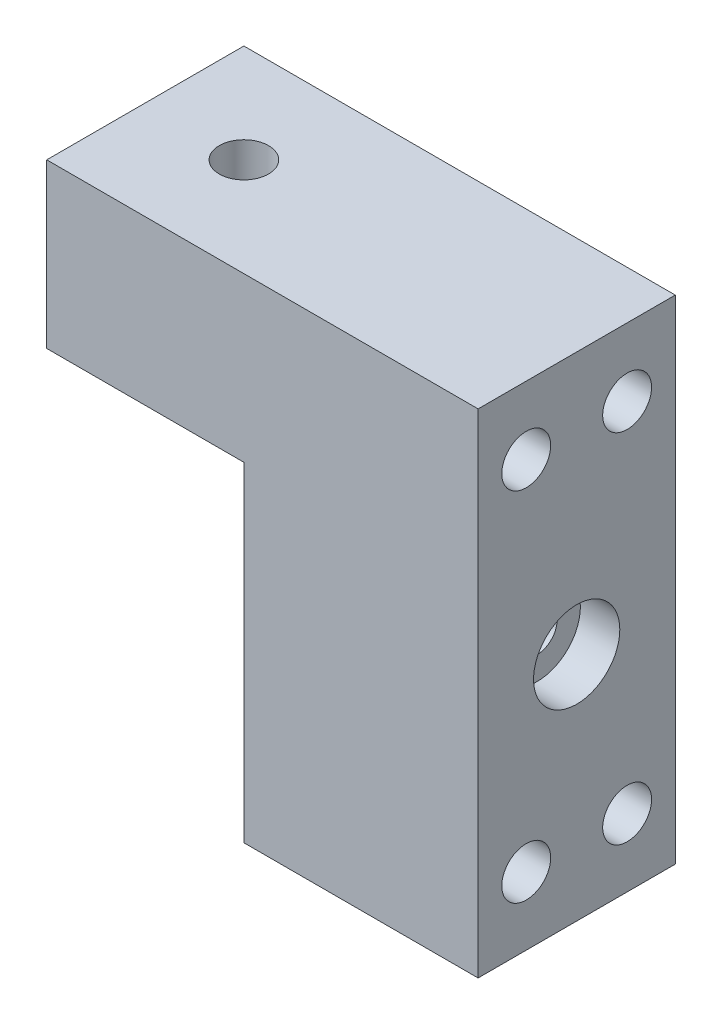
ISO-10303-21;
HEADER;
FILE_DESCRIPTION(('STEP AP214'),'2;1');
FILE_NAME('part.step','',(''),(''),'','','');
FILE_SCHEMA(('AUTOMOTIVE_DESIGN { 1 0 10303 214 1 1 1 1 }'));
ENDSEC;
DATA;
#1=APPLICATION_CONTEXT('core data for automotive mechanical design processes');
#2=APPLICATION_PROTOCOL_DEFINITION('international standard','automotive_design',2000,#1);
#3=PRODUCT_CONTEXT('',#1,'mechanical');
#4=PRODUCT('Part','Part','',(#3));
#5=PRODUCT_RELATED_PRODUCT_CATEGORY('part','',(#4));
#6=PRODUCT_DEFINITION_FORMATION('','',#4);
#7=PRODUCT_DEFINITION_CONTEXT('part definition',#1,'design');
#8=PRODUCT_DEFINITION('design','',#6,#7);
#9=PRODUCT_DEFINITION_SHAPE('','',#8);
#10=(LENGTH_UNIT() NAMED_UNIT(*) SI_UNIT(.MILLI.,.METRE.));
#11=(NAMED_UNIT(*) PLANE_ANGLE_UNIT() SI_UNIT($,.RADIAN.));
#12=(NAMED_UNIT(*) SI_UNIT($,.STERADIAN.) SOLID_ANGLE_UNIT());
#13=UNCERTAINTY_MEASURE_WITH_UNIT(LENGTH_MEASURE(1.E-05),#10,'distance_accuracy_value','');
#14=(GEOMETRIC_REPRESENTATION_CONTEXT(3) GLOBAL_UNCERTAINTY_ASSIGNED_CONTEXT((#13)) GLOBAL_UNIT_ASSIGNED_CONTEXT((#10,
#11,#12)) REPRESENTATION_CONTEXT('',''));
#15=CARTESIAN_POINT('',(0.,0.,0.));
#16=DIRECTION('',(0.,0.,1.));
#17=DIRECTION('',(1.,0.,0.));
#18=AXIS2_PLACEMENT_3D('',#15,#16,#17);
#19=CARTESIAN_POINT('',(-30.1759600000002,-375.537125805543,-189.91392924106));
#20=DIRECTION('',(1.,0.,0.));
#21=DIRECTION('',(0.,0.,-1.));
#22=AXIS2_PLACEMENT_3D('',#19,#20,#21);
#23=PLANE('',#22);
#24=CARTESIAN_POINT('',(-30.1759600000002,-381.861725805797,225.049350785073));
#25=DIRECTION('',(1.,0.,0.));
#26=DIRECTION('',(0.,0.,-1.));
#27=AXIS2_PLACEMENT_3D('',#24,#25,#26);
#28=CIRCLE('',#27,2.55270000000002);
#29=CARTESIAN_POINT('',(-30.1759600000002,-381.861725805797,222.496650785073));
#30=VERTEX_POINT('',#29);
#31=EDGE_CURVE('E118',#30,#30,#28,.T.);
#32=ORIENTED_EDGE('',*,*,#31,.T.);
#33=EDGE_LOOP('',(#32));
#34=FACE_BOUND('',#33,.T.);
#35=DIRECTION('',(0.,0.,1.));
#36=VECTOR('',#35,1.);
#37=CARTESIAN_POINT('',(-30.1759600000002,-369.161725805547,237.749350784974));
#38=LINE('',#37,#36);
#39=CARTESIAN_POINT('',(-30.1759600000002,-369.161725805547,212.349350784974));
#40=VERTEX_POINT('',#39);
#41=CARTESIAN_POINT('',(-30.1759600000002,-369.161725805547,237.749350784974));
#42=VERTEX_POINT('',#41);
#43=EDGE_CURVE('E49',#40,#42,#38,.T.);
#44=ORIENTED_EDGE('',*,*,#43,.F.);
#45=DIRECTION('',(0.,-1.,0.));
#46=VECTOR('',#45,1.);
#47=CARTESIAN_POINT('',(-30.1759600000002,-348.111725805595,212.349350784974));
#48=LINE('',#47,#46);
#49=CARTESIAN_POINT('',(-30.1759600000002,-411.611725805595,212.349350784974));
#50=VERTEX_POINT('',#49);
#51=EDGE_CURVE('E11',#40,#50,#48,.T.);
#52=ORIENTED_EDGE('',*,*,#51,.T.);
#53=DIRECTION('',(0.,0.,1.));
#54=VECTOR('',#53,1.);
#55=CARTESIAN_POINT('',(-30.1759600000002,-411.611725805595,212.349350784974));
#56=LINE('',#55,#54);
#57=CARTESIAN_POINT('',(-30.1759600000002,-411.611725805594,237.749350784974));
#58=VERTEX_POINT('',#57);
#59=EDGE_CURVE('E42',#50,#58,#56,.T.);
#60=ORIENTED_EDGE('',*,*,#59,.T.);
#61=DIRECTION('',(0.,1.,0.));
#62=VECTOR('',#61,1.);
#63=CARTESIAN_POINT('',(-30.1759600000002,-348.111725805595,237.749350784974));
#64=LINE('',#63,#62);
#65=EDGE_CURVE('E169',#58,#42,#64,.T.);
#66=ORIENTED_EDGE('',*,*,#65,.T.);
#67=EDGE_LOOP('',(#44,#52,#60,#66));
#68=FACE_BOUND('',#67,.T.);
#69=ADVANCED_FACE('F33',(#34,#68),#23,.F.);
#70=CARTESIAN_POINT('',(-98.5675530506084,-348.111725805595,212.349350784974));
#71=DIRECTION('',(0.,0.,-1.));
#72=DIRECTION('',(-1.,0.,0.));
#73=AXIS2_PLACEMENT_3D('',#70,#71,#72);
#74=PLANE('',#73);
#75=CARTESIAN_POINT('',(-9.78750000016149,-371.924225805582,212.349350784974));
#76=DIRECTION('',(0.,0.,-1.));
#77=DIRECTION('',(-1.,0.,0.));
#78=AXIS2_PLACEMENT_3D('',#75,#76,#77);
#79=CIRCLE('',#78,2.);
#80=CARTESIAN_POINT('',(-11.7875000001615,-371.924225805582,212.349350784974));
#81=VERTEX_POINT('',#80);
#82=EDGE_CURVE('E112',#81,#81,#79,.T.);
#83=ORIENTED_EDGE('',*,*,#82,.F.);
#84=EDGE_LOOP('',(#83));
#85=FACE_BOUND('',#84,.T.);
#86=CARTESIAN_POINT('',(-9.78750000016149,-387.799225805582,212.349350784974));
#87=DIRECTION('',(0.,0.,-1.));
#88=DIRECTION('',(-1.,0.,0.));
#89=AXIS2_PLACEMENT_3D('',#86,#87,#88);
#90=CIRCLE('',#89,2.);
#91=CARTESIAN_POINT('',(-11.7875000001615,-387.799225805582,212.349350784974));
#92=VERTEX_POINT('',#91);
#93=EDGE_CURVE('E111',#92,#92,#90,.T.);
#94=ORIENTED_EDGE('',*,*,#93,.F.);
#95=EDGE_LOOP('',(#94));
#96=FACE_BOUND('',#95,.T.);
#97=ORIENTED_EDGE('',*,*,#51,.F.);
#98=DIRECTION('',(1.,0.,0.));
#99=VECTOR('',#98,1.);
#100=CARTESIAN_POINT('',(-55.5759600000002,-369.161725805547,212.349350784974));
#101=LINE('',#100,#99);
#102=CARTESIAN_POINT('',(-55.5759600000002,-369.161725805547,212.349350784974));
#103=VERTEX_POINT('',#102);
#104=EDGE_CURVE('E165',#103,#40,#101,.T.);
#105=ORIENTED_EDGE('',*,*,#104,.F.);
#106=DIRECTION('',(0.,-1.,0.));
#107=VECTOR('',#106,1.);
#108=CARTESIAN_POINT('',(-55.5759600000002,-348.111725805595,212.349350784974));
#109=LINE('',#108,#107);
#110=CARTESIAN_POINT('',(-55.5759600000002,-348.111725805595,212.349350784974));
#111=VERTEX_POINT('',#110);
#112=EDGE_CURVE('E157',#111,#103,#109,.T.);
#113=ORIENTED_EDGE('',*,*,#112,.F.);
#114=DIRECTION('',(1.,0.,0.));
#115=VECTOR('',#114,1.);
#116=CARTESIAN_POINT('',(-98.5675530506084,-348.111725805595,212.349350784974));
#117=LINE('',#116,#115);
#118=CARTESIAN_POINT('',(0.,-348.111725805595,212.349350784974));
#119=VERTEX_POINT('',#118);
#120=EDGE_CURVE('E184',#111,#119,#117,.T.);
#121=ORIENTED_EDGE('',*,*,#120,.T.);
#122=DIRECTION('',(0.,1.,0.));
#123=VECTOR('',#122,1.);
#124=CARTESIAN_POINT('',(0.,-348.111725805595,212.349350784974));
#125=LINE('',#124,#123);
#126=CARTESIAN_POINT('',(0.,-411.611725805595,212.349350784974));
#127=VERTEX_POINT('',#126);
#128=EDGE_CURVE('E168',#127,#119,#125,.T.);
#129=ORIENTED_EDGE('',*,*,#128,.F.);
#130=DIRECTION('',(1.,0.,0.));
#131=VECTOR('',#130,1.);
#132=CARTESIAN_POINT('',(-98.5675530506084,-411.611725805595,212.349350784974));
#133=LINE('',#132,#131);
#134=EDGE_CURVE('E171',#50,#127,#133,.T.);
#135=ORIENTED_EDGE('',*,*,#134,.F.);
#136=EDGE_LOOP('',(#97,#105,#113,#121,#129,#135));
#137=FACE_BOUND('',#136,.T.);
#138=ADVANCED_FACE('F35',(#85,#96,#137),#74,.T.);
#139=CARTESIAN_POINT('',(-98.5675530506084,-411.611725805595,212.349350784974));
#140=DIRECTION('',(0.,-1.,0.));
#141=DIRECTION('',(0.,0.,-1.));
#142=AXIS2_PLACEMENT_3D('',#139,#140,#141);
#143=PLANE('',#142);
#144=ORIENTED_EDGE('',*,*,#59,.F.);
#145=ORIENTED_EDGE('',*,*,#134,.T.);
#146=DIRECTION('',(0.,0.,-1.));
#147=VECTOR('',#146,1.);
#148=CARTESIAN_POINT('',(0.,-411.611725805595,212.349350784974));
#149=LINE('',#148,#147);
#150=CARTESIAN_POINT('',(0.,-411.611725805595,237.749350784974));
#151=VERTEX_POINT('',#150);
#152=EDGE_CURVE('E181',#151,#127,#149,.T.);
#153=ORIENTED_EDGE('',*,*,#152,.F.);
#154=DIRECTION('',(1.,0.,0.));
#155=VECTOR('',#154,1.);
#156=CARTESIAN_POINT('',(-98.5675530506084,-411.611725805595,237.749350784974));
#157=LINE('',#156,#155);
#158=EDGE_CURVE('E186',#58,#151,#157,.T.);
#159=ORIENTED_EDGE('',*,*,#158,.F.);
#160=EDGE_LOOP('',(#144,#145,#153,#159));
#161=FACE_BOUND('',#160,.T.);
#162=ADVANCED_FACE('F204',(#161),#143,.T.);
#163=CARTESIAN_POINT('',(-98.5675530506084,-348.111725805595,237.749350784974));
#164=DIRECTION('',(0.,0.,1.));
#165=DIRECTION('',(1.,0.,0.));
#166=AXIS2_PLACEMENT_3D('',#163,#164,#165);
#167=PLANE('',#166);
#168=ORIENTED_EDGE('',*,*,#65,.F.);
#169=ORIENTED_EDGE('',*,*,#158,.T.);
#170=DIRECTION('',(0.,-1.,0.));
#171=VECTOR('',#170,1.);
#172=CARTESIAN_POINT('',(0.,-348.111725805595,237.749350784974));
#173=LINE('',#172,#171);
#174=CARTESIAN_POINT('',(0.,-348.111725805595,237.749350784974));
#175=VERTEX_POINT('',#174);
#176=EDGE_CURVE('E178',#175,#151,#173,.T.);
#177=ORIENTED_EDGE('',*,*,#176,.F.);
#178=DIRECTION('',(1.,0.,0.));
#179=VECTOR('',#178,1.);
#180=CARTESIAN_POINT('',(-98.5675530506084,-348.111725805595,237.749350784974));
#181=LINE('',#180,#179);
#182=CARTESIAN_POINT('',(-55.5759600000002,-348.111725805595,237.749350784974));
#183=VERTEX_POINT('',#182);
#184=EDGE_CURVE('E188',#183,#175,#181,.T.);
#185=ORIENTED_EDGE('',*,*,#184,.F.);
#186=DIRECTION('',(0.,1.,0.));
#187=VECTOR('',#186,1.);
#188=CARTESIAN_POINT('',(-55.5759600000002,-348.111725805595,237.749350784974));
#189=LINE('',#188,#187);
#190=CARTESIAN_POINT('',(-55.5759600000002,-369.161725805547,237.749350784974));
#191=VERTEX_POINT('',#190);
#192=EDGE_CURVE('E151',#191,#183,#189,.T.);
#193=ORIENTED_EDGE('',*,*,#192,.F.);
#194=DIRECTION('',(1.,0.,0.));
#195=VECTOR('',#194,1.);
#196=CARTESIAN_POINT('',(-55.5759600000002,-369.161725805547,237.749350784974));
#197=LINE('',#196,#195);
#198=EDGE_CURVE('E161',#191,#42,#197,.T.);
#199=ORIENTED_EDGE('',*,*,#198,.T.);
#200=EDGE_LOOP('',(#168,#169,#177,#185,#193,#199));
#201=FACE_BOUND('',#200,.T.);
#202=ADVANCED_FACE('F213',(#201),#167,.T.);
#203=CARTESIAN_POINT('',(-98.5675530506084,-348.111725805595,212.349350784974));
#204=DIRECTION('',(0.,1.,0.));
#205=DIRECTION('',(0.,0.,1.));
#206=AXIS2_PLACEMENT_3D('',#203,#204,#205);
#207=PLANE('',#206);
#208=CARTESIAN_POINT('',(-42.8759600000002,-348.111725805595,225.049350784974));
#209=DIRECTION('',(0.,1.,0.));
#210=DIRECTION('',(0.,0.,1.));
#211=AXIS2_PLACEMENT_3D('',#208,#209,#210);
#212=CIRCLE('',#211,3.17499999999998);
#213=CARTESIAN_POINT('',(-42.8759600000002,-348.111725805595,228.224350784974));
#214=VERTEX_POINT('',#213);
#215=EDGE_CURVE('E148',#214,#214,#212,.T.);
#216=ORIENTED_EDGE('',*,*,#215,.F.);
#217=EDGE_LOOP('',(#216));
#218=FACE_BOUND('',#217,.T.);
#219=ORIENTED_EDGE('',*,*,#120,.F.);
#220=DIRECTION('',(0.,0.,-1.));
#221=VECTOR('',#220,1.);
#222=CARTESIAN_POINT('',(-55.5759600000002,-348.111725805595,237.749350784974));
#223=LINE('',#222,#221);
#224=EDGE_CURVE('E154',#183,#111,#223,.T.);
#225=ORIENTED_EDGE('',*,*,#224,.F.);
#226=ORIENTED_EDGE('',*,*,#184,.T.);
#227=DIRECTION('',(0.,0.,1.));
#228=VECTOR('',#227,1.);
#229=CARTESIAN_POINT('',(0.,-348.111725805595,212.349350784974));
#230=LINE('',#229,#228);
#231=EDGE_CURVE('E175',#119,#175,#230,.T.);
#232=ORIENTED_EDGE('',*,*,#231,.F.);
#233=EDGE_LOOP('',(#219,#225,#226,#232));
#234=FACE_BOUND('',#233,.T.);
#235=ADVANCED_FACE('F197',(#218,#234),#207,.T.);
#236=CARTESIAN_POINT('',(0.,0.,0.));
#237=DIRECTION('',(-1.,0.,0.));
#238=DIRECTION('',(0.,0.,1.));
#239=AXIS2_PLACEMENT_3D('',#236,#237,#238);
#240=PLANE('',#239);
#241=CARTESIAN_POINT('',(0.,-381.861725805797,225.049350785073));
#242=DIRECTION('',(1.,0.,0.));
#243=DIRECTION('',(0.,0.,-1.));
#244=AXIS2_PLACEMENT_3D('',#241,#242,#243);
#245=CIRCLE('',#244,5.55624999999998);
#246=CARTESIAN_POINT('',(0.,-381.861725805797,219.493100785073));
#247=VERTEX_POINT('',#246);
#248=EDGE_CURVE('E311',#247,#247,#245,.T.);
#249=ORIENTED_EDGE('',*,*,#248,.F.);
#250=EDGE_LOOP('',(#249));
#251=FACE_BOUND('',#250,.T.);
#252=CARTESIAN_POINT('',(0.,-356.861725805605,231.549350784858));
#253=DIRECTION('',(1.,0.,0.));
#254=DIRECTION('',(0.,0.,-1.));
#255=AXIS2_PLACEMENT_3D('',#252,#253,#254);
#256=CIRCLE('',#255,3.14999999999999);
#257=CARTESIAN_POINT('',(0.,-356.861725805605,228.399350784858));
#258=VERTEX_POINT('',#257);
#259=EDGE_CURVE('E124',#258,#258,#256,.T.);
#260=ORIENTED_EDGE('',*,*,#259,.F.);
#261=EDGE_LOOP('',(#260));
#262=FACE_BOUND('',#261,.T.);
#263=CARTESIAN_POINT('',(0.,-356.861725805605,218.549350784858));
#264=DIRECTION('',(1.,0.,0.));
#265=DIRECTION('',(0.,0.,-1.));
#266=AXIS2_PLACEMENT_3D('',#263,#264,#265);
#267=CIRCLE('',#266,3.14999999999999);
#268=CARTESIAN_POINT('',(0.,-356.861725805605,215.399350784858));
#269=VERTEX_POINT('',#268);
#270=EDGE_CURVE('E130',#269,#269,#267,.T.);
#271=ORIENTED_EDGE('',*,*,#270,.F.);
#272=EDGE_LOOP('',(#271));
#273=FACE_BOUND('',#272,.T.);
#274=CARTESIAN_POINT('',(0.,-402.861725805605,218.549350784858));
#275=DIRECTION('',(1.,0.,0.));
#276=DIRECTION('',(0.,0.,-1.));
#277=AXIS2_PLACEMENT_3D('',#274,#275,#276);
#278=CIRCLE('',#277,3.14999999999999);
#279=CARTESIAN_POINT('',(0.,-402.861725805605,215.399350784858));
#280=VERTEX_POINT('',#279);
#281=EDGE_CURVE('E136',#280,#280,#278,.T.);
#282=ORIENTED_EDGE('',*,*,#281,.F.);
#283=EDGE_LOOP('',(#282));
#284=FACE_BOUND('',#283,.T.);
#285=CARTESIAN_POINT('',(0.,-402.861725805605,231.549350784858));
#286=DIRECTION('',(1.,0.,0.));
#287=DIRECTION('',(0.,0.,-1.));
#288=AXIS2_PLACEMENT_3D('',#285,#286,#287);
#289=CIRCLE('',#288,3.14999999999999);
#290=CARTESIAN_POINT('',(0.,-402.861725805605,228.399350784858));
#291=VERTEX_POINT('',#290);
#292=EDGE_CURVE('E142',#291,#291,#289,.T.);
#293=ORIENTED_EDGE('',*,*,#292,.F.);
#294=EDGE_LOOP('',(#293));
#295=FACE_BOUND('',#294,.T.);
#296=ORIENTED_EDGE('',*,*,#128,.T.);
#297=ORIENTED_EDGE('',*,*,#231,.T.);
#298=ORIENTED_EDGE('',*,*,#176,.T.);
#299=ORIENTED_EDGE('',*,*,#152,.T.);
#300=EDGE_LOOP('',(#296,#297,#298,#299));
#301=FACE_BOUND('',#300,.T.);
#302=ADVANCED_FACE('F200',(#251,#262,#273,#284,#295,#301),#240,.F.);
#303=CARTESIAN_POINT('',(-55.5759600000002,-369.161725805547,237.749350784974));
#304=DIRECTION('',(0.,1.,0.));
#305=DIRECTION('',(0.,0.,1.));
#306=AXIS2_PLACEMENT_3D('',#303,#304,#305);
#307=PLANE('',#306);
#308=CARTESIAN_POINT('',(-42.8759600000002,-369.161725805547,225.049350784974));
#309=DIRECTION('',(0.,1.,0.));
#310=DIRECTION('',(0.,0.,1.));
#311=AXIS2_PLACEMENT_3D('',#308,#309,#310);
#312=CIRCLE('',#311,3.17499999999999);
#313=CARTESIAN_POINT('',(-42.8759600000002,-369.161725805547,228.224350784974));
#314=VERTEX_POINT('',#313);
#315=EDGE_CURVE('E37',#314,#314,#312,.T.);
#316=ORIENTED_EDGE('',*,*,#315,.T.);
#317=EDGE_LOOP('',(#316));
#318=FACE_BOUND('',#317,.T.);
#319=ORIENTED_EDGE('',*,*,#43,.T.);
#320=ORIENTED_EDGE('',*,*,#198,.F.);
#321=DIRECTION('',(0.,0.,1.));
#322=VECTOR('',#321,1.);
#323=CARTESIAN_POINT('',(-55.5759600000002,-369.161725805547,237.749350784974));
#324=LINE('',#323,#322);
#325=EDGE_CURVE('E159',#103,#191,#324,.T.);
#326=ORIENTED_EDGE('',*,*,#325,.F.);
#327=ORIENTED_EDGE('',*,*,#104,.T.);
#328=EDGE_LOOP('',(#319,#320,#326,#327));
#329=FACE_BOUND('',#328,.T.);
#330=ADVANCED_FACE('F207',(#318,#329),#307,.F.);
#331=CARTESIAN_POINT('',(-55.5759600000002,0.,0.));
#332=DIRECTION('',(1.,0.,0.));
#333=DIRECTION('',(0.,0.,-1.));
#334=AXIS2_PLACEMENT_3D('',#331,#332,#333);
#335=PLANE('',#334);
#336=ORIENTED_EDGE('',*,*,#192,.T.);
#337=ORIENTED_EDGE('',*,*,#224,.T.);
#338=ORIENTED_EDGE('',*,*,#112,.T.);
#339=ORIENTED_EDGE('',*,*,#325,.T.);
#340=EDGE_LOOP('',(#336,#337,#338,#339));
#341=FACE_BOUND('',#340,.T.);
#342=ADVANCED_FACE('F211',(#341),#335,.F.);
#343=CARTESIAN_POINT('',(-42.8759600000002,-348.111725805595,225.049350784974));
#344=DIRECTION('',(0.,1.,0.));
#345=DIRECTION('',(0.,0.,1.));
#346=AXIS2_PLACEMENT_3D('',#343,#344,#345);
#347=CYLINDRICAL_SURFACE('',#346,3.17499999999999);
#348=ORIENTED_EDGE('',*,*,#215,.T.);
#349=EDGE_LOOP('',(#348));
#350=FACE_BOUND('',#349,.T.);
#351=ORIENTED_EDGE('',*,*,#315,.F.);
#352=EDGE_LOOP('',(#351));
#353=FACE_BOUND('',#352,.T.);
#354=ADVANCED_FACE('F237',(#350,#353),#347,.F.);
#355=CARTESIAN_POINT('',(-8.9916,-402.861725805605,231.549350784858));
#356=DIRECTION('',(1.,0.,0.));
#357=DIRECTION('',(0.,0.,-1.));
#358=AXIS2_PLACEMENT_3D('',#355,#356,#357);
#359=CONICAL_SURFACE('',#358,3.14999999999999,1.02974425867665);
#360=CARTESIAN_POINT('',(-10.8843109499368,-402.861725805605,231.549350784858));
#361=VERTEX_POINT('',#360);
#362=VERTEX_LOOP('',#361);
#363=FACE_BOUND('',#362,.T.);
#364=CARTESIAN_POINT('',(-8.9916,-402.861725805605,231.549350784858));
#365=DIRECTION('',(1.,0.,0.));
#366=DIRECTION('',(0.,0.,-1.));
#367=AXIS2_PLACEMENT_3D('',#364,#365,#366);
#368=CIRCLE('',#367,3.14999999999999);
#369=CARTESIAN_POINT('',(-8.9916,-402.861725805605,228.399350784858));
#370=VERTEX_POINT('',#369);
#371=EDGE_CURVE('E145',#370,#370,#368,.T.);
#372=ORIENTED_EDGE('',*,*,#371,.T.);
#373=EDGE_LOOP('',(#372));
#374=FACE_BOUND('',#373,.T.);
#375=ADVANCED_FACE('F240',(#363,#374),#359,.F.);
#376=CARTESIAN_POINT('',(0.,-402.861725805605,231.549350784858));
#377=DIRECTION('',(1.,0.,0.));
#378=DIRECTION('',(0.,0.,-1.));
#379=AXIS2_PLACEMENT_3D('',#376,#377,#378);
#380=CYLINDRICAL_SURFACE('',#379,3.14999999999999);
#381=ORIENTED_EDGE('',*,*,#371,.F.);
#382=EDGE_LOOP('',(#381));
#383=FACE_BOUND('',#382,.T.);
#384=ORIENTED_EDGE('',*,*,#292,.T.);
#385=EDGE_LOOP('',(#384));
#386=FACE_BOUND('',#385,.T.);
#387=ADVANCED_FACE('F254',(#383,#386),#380,.F.);
#388=CARTESIAN_POINT('',(-8.9916,-402.861725805605,218.549350784858));
#389=DIRECTION('',(1.,0.,0.));
#390=DIRECTION('',(0.,0.,-1.));
#391=AXIS2_PLACEMENT_3D('',#388,#389,#390);
#392=CONICAL_SURFACE('',#391,3.14999999999999,1.02974425867665);
#393=CARTESIAN_POINT('',(-10.8843109499368,-402.861725805605,218.549350784858));
#394=VERTEX_POINT('',#393);
#395=VERTEX_LOOP('',#394);
#396=FACE_BOUND('',#395,.T.);
#397=CARTESIAN_POINT('',(-8.9916,-402.861725805605,218.549350784858));
#398=DIRECTION('',(1.,0.,0.));
#399=DIRECTION('',(0.,0.,-1.));
#400=AXIS2_PLACEMENT_3D('',#397,#398,#399);
#401=CIRCLE('',#400,3.14999999999999);
#402=CARTESIAN_POINT('',(-8.9916,-402.861725805605,215.399350784858));
#403=VERTEX_POINT('',#402);
#404=EDGE_CURVE('E139',#403,#403,#401,.T.);
#405=ORIENTED_EDGE('',*,*,#404,.T.);
#406=EDGE_LOOP('',(#405));
#407=FACE_BOUND('',#406,.T.);
#408=ADVANCED_FACE('F258',(#396,#407),#392,.F.);
#409=CARTESIAN_POINT('',(0.,-402.861725805605,218.549350784858));
#410=DIRECTION('',(1.,0.,0.));
#411=DIRECTION('',(0.,0.,-1.));
#412=AXIS2_PLACEMENT_3D('',#409,#410,#411);
#413=CYLINDRICAL_SURFACE('',#412,3.14999999999999);
#414=ORIENTED_EDGE('',*,*,#404,.F.);
#415=EDGE_LOOP('',(#414));
#416=FACE_BOUND('',#415,.T.);
#417=ORIENTED_EDGE('',*,*,#281,.T.);
#418=EDGE_LOOP('',(#417));
#419=FACE_BOUND('',#418,.T.);
#420=ADVANCED_FACE('F262',(#416,#419),#413,.F.);
#421=CARTESIAN_POINT('',(-8.9916,-356.861725805605,218.549350784858));
#422=DIRECTION('',(1.,0.,0.));
#423=DIRECTION('',(0.,0.,-1.));
#424=AXIS2_PLACEMENT_3D('',#421,#422,#423);
#425=CONICAL_SURFACE('',#424,3.14999999999999,1.02974425867665);
#426=CARTESIAN_POINT('',(-10.8843109499368,-356.861725805605,218.549350784858));
#427=VERTEX_POINT('',#426);
#428=VERTEX_LOOP('',#427);
#429=FACE_BOUND('',#428,.T.);
#430=CARTESIAN_POINT('',(-8.9916,-356.861725805605,218.549350784858));
#431=DIRECTION('',(1.,0.,0.));
#432=DIRECTION('',(0.,0.,-1.));
#433=AXIS2_PLACEMENT_3D('',#430,#431,#432);
#434=CIRCLE('',#433,3.14999999999999);
#435=CARTESIAN_POINT('',(-8.9916,-356.861725805605,215.399350784858));
#436=VERTEX_POINT('',#435);
#437=EDGE_CURVE('E133',#436,#436,#434,.T.);
#438=ORIENTED_EDGE('',*,*,#437,.T.);
#439=EDGE_LOOP('',(#438));
#440=FACE_BOUND('',#439,.T.);
#441=ADVANCED_FACE('F266',(#429,#440),#425,.F.);
#442=CARTESIAN_POINT('',(0.,-356.861725805605,218.549350784858));
#443=DIRECTION('',(1.,0.,0.));
#444=DIRECTION('',(0.,0.,-1.));
#445=AXIS2_PLACEMENT_3D('',#442,#443,#444);
#446=CYLINDRICAL_SURFACE('',#445,3.14999999999999);
#447=ORIENTED_EDGE('',*,*,#437,.F.);
#448=EDGE_LOOP('',(#447));
#449=FACE_BOUND('',#448,.T.);
#450=ORIENTED_EDGE('',*,*,#270,.T.);
#451=EDGE_LOOP('',(#450));
#452=FACE_BOUND('',#451,.T.);
#453=ADVANCED_FACE('F270',(#449,#452),#446,.F.);
#454=CARTESIAN_POINT('',(-8.9916,-356.861725805605,231.549350784858));
#455=DIRECTION('',(1.,0.,0.));
#456=DIRECTION('',(0.,0.,-1.));
#457=AXIS2_PLACEMENT_3D('',#454,#455,#456);
#458=CONICAL_SURFACE('',#457,3.14999999999999,1.02974425867665);
#459=CARTESIAN_POINT('',(-10.8843109499368,-356.861725805605,231.549350784858));
#460=VERTEX_POINT('',#459);
#461=VERTEX_LOOP('',#460);
#462=FACE_BOUND('',#461,.T.);
#463=CARTESIAN_POINT('',(-8.9916,-356.861725805605,231.549350784858));
#464=DIRECTION('',(1.,0.,0.));
#465=DIRECTION('',(0.,0.,-1.));
#466=AXIS2_PLACEMENT_3D('',#463,#464,#465);
#467=CIRCLE('',#466,3.14999999999999);
#468=CARTESIAN_POINT('',(-8.9916,-356.861725805605,228.399350784858));
#469=VERTEX_POINT('',#468);
#470=EDGE_CURVE('E127',#469,#469,#467,.T.);
#471=ORIENTED_EDGE('',*,*,#470,.T.);
#472=EDGE_LOOP('',(#471));
#473=FACE_BOUND('',#472,.T.);
#474=ADVANCED_FACE('F274',(#462,#473),#458,.F.);
#475=CARTESIAN_POINT('',(0.,-356.861725805605,231.549350784858));
#476=DIRECTION('',(1.,0.,0.));
#477=DIRECTION('',(0.,0.,-1.));
#478=AXIS2_PLACEMENT_3D('',#475,#476,#477);
#479=CYLINDRICAL_SURFACE('',#478,3.14999999999999);
#480=ORIENTED_EDGE('',*,*,#470,.F.);
#481=EDGE_LOOP('',(#480));
#482=FACE_BOUND('',#481,.T.);
#483=ORIENTED_EDGE('',*,*,#259,.T.);
#484=EDGE_LOOP('',(#483));
#485=FACE_BOUND('',#484,.T.);
#486=ADVANCED_FACE('F278',(#482,#485),#479,.F.);
#487=CARTESIAN_POINT('',(-9.78750000016149,-387.799225805582,227.589350784974));
#488=DIRECTION('',(0.,0.,-1.));
#489=DIRECTION('',(-1.,0.,0.));
#490=AXIS2_PLACEMENT_3D('',#487,#488,#489);
#491=CONICAL_SURFACE('',#490,2.,1.02974425867665);
#492=CARTESIAN_POINT('',(-9.78750000016149,-387.799225805582,228.791072023029));
#493=VERTEX_POINT('',#492);
#494=VERTEX_LOOP('',#493);
#495=FACE_BOUND('',#494,.T.);
#496=CARTESIAN_POINT('',(-9.78750000016149,-387.799225805582,227.589350784974));
#497=DIRECTION('',(0.,0.,-1.));
#498=DIRECTION('',(-1.,0.,0.));
#499=AXIS2_PLACEMENT_3D('',#496,#497,#498);
#500=CIRCLE('',#499,2.);
#501=CARTESIAN_POINT('',(-11.7875000001615,-387.799225805582,227.589350784974));
#502=VERTEX_POINT('',#501);
#503=EDGE_CURVE('E115',#502,#502,#500,.T.);
#504=ORIENTED_EDGE('',*,*,#503,.T.);
#505=EDGE_LOOP('',(#504));
#506=FACE_BOUND('',#505,.T.);
#507=ADVANCED_FACE('F282',(#495,#506),#491,.F.);
#508=CARTESIAN_POINT('',(-9.78750000016149,-387.799225805582,212.349350784974));
#509=DIRECTION('',(0.,0.,-1.));
#510=DIRECTION('',(-1.,0.,0.));
#511=AXIS2_PLACEMENT_3D('',#508,#509,#510);
#512=CYLINDRICAL_SURFACE('',#511,2.);
#513=ORIENTED_EDGE('',*,*,#503,.F.);
#514=EDGE_LOOP('',(#513));
#515=FACE_BOUND('',#514,.T.);
#516=ORIENTED_EDGE('',*,*,#93,.T.);
#517=EDGE_LOOP('',(#516));
#518=FACE_BOUND('',#517,.T.);
#519=ADVANCED_FACE('F105',(#515,#518),#512,.F.);
#520=CARTESIAN_POINT('',(-9.78750000016149,-371.924225805582,227.589350784974));
#521=DIRECTION('',(0.,0.,-1.));
#522=DIRECTION('',(-1.,0.,0.));
#523=AXIS2_PLACEMENT_3D('',#520,#521,#522);
#524=CONICAL_SURFACE('',#523,2.,1.02974425867665);
#525=CARTESIAN_POINT('',(-9.78750000016149,-371.924225805582,228.791072023029));
#526=VERTEX_POINT('',#525);
#527=VERTEX_LOOP('',#526);
#528=FACE_BOUND('',#527,.T.);
#529=CARTESIAN_POINT('',(-9.78750000016149,-371.924225805582,227.589350784974));
#530=DIRECTION('',(0.,0.,-1.));
#531=DIRECTION('',(-1.,0.,0.));
#532=AXIS2_PLACEMENT_3D('',#529,#530,#531);
#533=CIRCLE('',#532,2.);
#534=CARTESIAN_POINT('',(-11.7875000001615,-371.924225805582,227.589350784974));
#535=VERTEX_POINT('',#534);
#536=EDGE_CURVE('E109',#535,#535,#533,.T.);
#537=ORIENTED_EDGE('',*,*,#536,.T.);
#538=EDGE_LOOP('',(#537));
#539=FACE_BOUND('',#538,.T.);
#540=ADVANCED_FACE('F101',(#528,#539),#524,.F.);
#541=CARTESIAN_POINT('',(-9.78750000016149,-371.924225805582,212.349350784974));
#542=DIRECTION('',(0.,0.,-1.));
#543=DIRECTION('',(-1.,0.,0.));
#544=AXIS2_PLACEMENT_3D('',#541,#542,#543);
#545=CYLINDRICAL_SURFACE('',#544,2.);
#546=ORIENTED_EDGE('',*,*,#536,.F.);
#547=EDGE_LOOP('',(#546));
#548=FACE_BOUND('',#547,.T.);
#549=ORIENTED_EDGE('',*,*,#82,.T.);
#550=EDGE_LOOP('',(#549));
#551=FACE_BOUND('',#550,.T.);
#552=ADVANCED_FACE('F104',(#548,#551),#545,.F.);
#553=CARTESIAN_POINT('',(0.,-381.861725805797,225.049350785073));
#554=DIRECTION('',(1.,0.,0.));
#555=DIRECTION('',(0.,0.,-1.));
#556=AXIS2_PLACEMENT_3D('',#553,#554,#555);
#557=CYLINDRICAL_SURFACE('',#556,2.55270000000002);
#558=ORIENTED_EDGE('',*,*,#31,.F.);
#559=EDGE_LOOP('',(#558));
#560=FACE_BOUND('',#559,.T.);
#561=CARTESIAN_POINT('',(-5.08,-381.861725805797,225.049350785073));
#562=DIRECTION('',(1.,0.,0.));
#563=DIRECTION('',(0.,0.,-1.));
#564=AXIS2_PLACEMENT_3D('',#561,#562,#563);
#565=CIRCLE('',#564,2.55270000000002);
#566=CARTESIAN_POINT('',(-5.08,-381.861725805797,222.496650785073));
#567=VERTEX_POINT('',#566);
#568=EDGE_CURVE('E313',#567,#567,#565,.T.);
#569=ORIENTED_EDGE('',*,*,#568,.T.);
#570=EDGE_LOOP('',(#569));
#571=FACE_BOUND('',#570,.T.);
#572=ADVANCED_FACE('F292',(#560,#571),#557,.F.);
#573=CARTESIAN_POINT('',(-5.08,-379.309025805797,225.049350785073));
#574=DIRECTION('',(-1.,0.,0.));
#575=DIRECTION('',(0.,0.,1.));
#576=AXIS2_PLACEMENT_3D('',#573,#574,#575);
#577=PLANE('',#576);
#578=ORIENTED_EDGE('',*,*,#568,.F.);
#579=EDGE_LOOP('',(#578));
#580=FACE_BOUND('',#579,.T.);
#581=CARTESIAN_POINT('',(-5.08,-381.861725805797,225.049350785073));
#582=DIRECTION('',(1.,0.,0.));
#583=DIRECTION('',(0.,0.,-1.));
#584=AXIS2_PLACEMENT_3D('',#581,#582,#583);
#585=CIRCLE('',#584,5.55624999999998);
#586=CARTESIAN_POINT('',(-5.08,-381.861725805797,219.493100785073));
#587=VERTEX_POINT('',#586);
#588=EDGE_CURVE('E308',#587,#587,#585,.T.);
#589=ORIENTED_EDGE('',*,*,#588,.T.);
#590=EDGE_LOOP('',(#589));
#591=FACE_BOUND('',#590,.T.);
#592=ADVANCED_FACE('F295',(#580,#591),#577,.F.);
#593=CARTESIAN_POINT('',(0.,-381.861725805797,225.049350785073));
#594=DIRECTION('',(1.,0.,0.));
#595=DIRECTION('',(0.,0.,-1.));
#596=AXIS2_PLACEMENT_3D('',#593,#594,#595);
#597=CYLINDRICAL_SURFACE('',#596,5.55624999999998);
#598=ORIENTED_EDGE('',*,*,#588,.F.);
#599=EDGE_LOOP('',(#598));
#600=FACE_BOUND('',#599,.T.);
#601=ORIENTED_EDGE('',*,*,#248,.T.);
#602=EDGE_LOOP('',(#601));
#603=FACE_BOUND('',#602,.T.);
#604=ADVANCED_FACE('F299',(#600,#603),#597,.F.);
#605=CLOSED_SHELL('',(#69,#138,#162,#202,#235,#302,#330,#342,#354,#375,#387,#408,#420,#441,#453,
#474,#486,#507,#519,#540,#552,#572,#592,#604));
#606=MANIFOLD_SOLID_BREP('B2',#605);
#607=ADVANCED_BREP_SHAPE_REPRESENTATION('',(#18,#606),#14);
#608=SHAPE_DEFINITION_REPRESENTATION(#9,#607);
ENDSEC;
END-ISO-10303-21;
